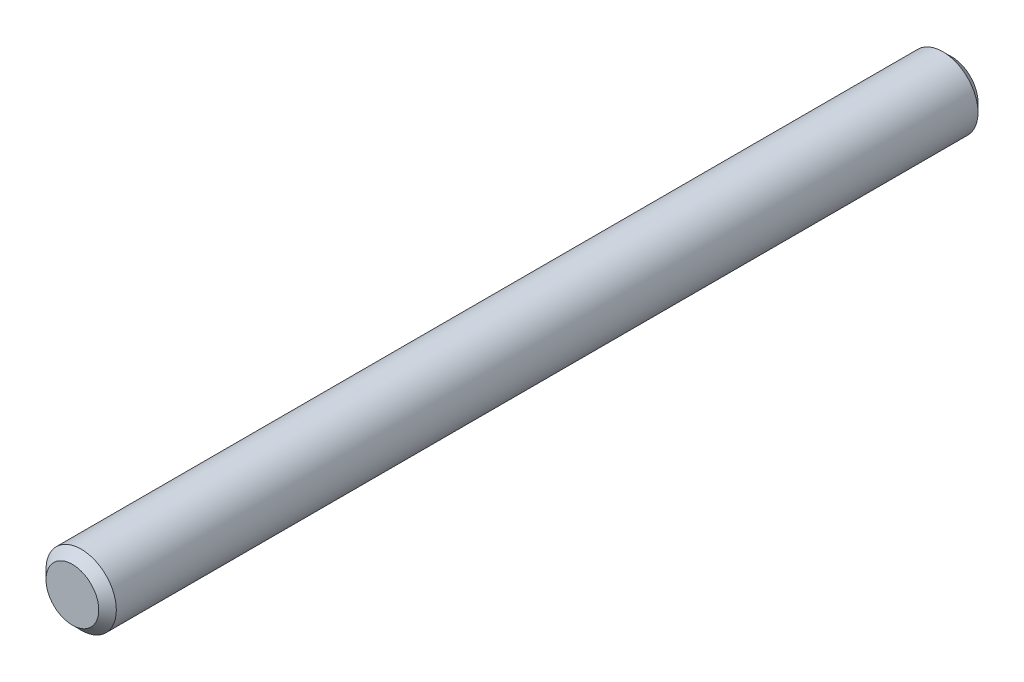
ISO-10303-21;
HEADER;
FILE_DESCRIPTION(('STEP AP214'),'2;1');
FILE_NAME('part.step','',(''),(''),'','','');
FILE_SCHEMA(('AUTOMOTIVE_DESIGN { 1 0 10303 214 1 1 1 1 }'));
ENDSEC;
DATA;
#1=APPLICATION_CONTEXT('core data for automotive mechanical design processes');
#2=APPLICATION_PROTOCOL_DEFINITION('international standard','automotive_design',2000,#1);
#3=PRODUCT_CONTEXT('',#1,'mechanical');
#4=PRODUCT('Part','Part','',(#3));
#5=PRODUCT_RELATED_PRODUCT_CATEGORY('part','',(#4));
#6=PRODUCT_DEFINITION_FORMATION('','',#4);
#7=PRODUCT_DEFINITION_CONTEXT('part definition',#1,'design');
#8=PRODUCT_DEFINITION('design','',#6,#7);
#9=PRODUCT_DEFINITION_SHAPE('','',#8);
#10=(LENGTH_UNIT() NAMED_UNIT(*) SI_UNIT(.MILLI.,.METRE.));
#11=(NAMED_UNIT(*) PLANE_ANGLE_UNIT() SI_UNIT($,.RADIAN.));
#12=(NAMED_UNIT(*) SI_UNIT($,.STERADIAN.) SOLID_ANGLE_UNIT());
#13=UNCERTAINTY_MEASURE_WITH_UNIT(LENGTH_MEASURE(1.E-05),#10,'distance_accuracy_value','');
#14=(GEOMETRIC_REPRESENTATION_CONTEXT(3) GLOBAL_UNCERTAINTY_ASSIGNED_CONTEXT((#13)) GLOBAL_UNIT_ASSIGNED_CONTEXT((#10,
#11,#12)) REPRESENTATION_CONTEXT('',''));
#15=CARTESIAN_POINT('',(0.,0.,0.));
#16=DIRECTION('',(0.,0.,1.));
#17=DIRECTION('',(1.,0.,0.));
#18=AXIS2_PLACEMENT_3D('',#15,#16,#17);
#19=CARTESIAN_POINT('',(0.,0.,25.));
#20=DIRECTION('',(0.,0.,-1.));
#21=DIRECTION('',(-1.,0.,0.));
#22=AXIS2_PLACEMENT_3D('',#19,#20,#21);
#23=CYLINDRICAL_SURFACE('',#22,2.);
#24=CARTESIAN_POINT('',(0.,0.,-24.5));
#25=DIRECTION('',(0.,0.,1.));
#26=DIRECTION('',(1.,0.,0.));
#27=AXIS2_PLACEMENT_3D('',#24,#25,#26);
#28=CIRCLE('',#27,2.);
#29=CARTESIAN_POINT('',(2.,0.,-24.5));
#30=VERTEX_POINT('',#29);
#31=EDGE_CURVE('E27',#30,#30,#28,.T.);
#32=ORIENTED_EDGE('',*,*,#31,.T.);
#33=EDGE_LOOP('',(#32));
#34=FACE_BOUND('',#33,.T.);
#35=CARTESIAN_POINT('',(0.,0.,24.5));
#36=DIRECTION('',(0.,0.,1.));
#37=DIRECTION('',(1.,0.,0.));
#38=AXIS2_PLACEMENT_3D('',#35,#36,#37);
#39=CIRCLE('',#38,2.);
#40=CARTESIAN_POINT('',(2.,0.,24.5));
#41=VERTEX_POINT('',#40);
#42=EDGE_CURVE('E31',#41,#41,#39,.F.);
#43=ORIENTED_EDGE('',*,*,#42,.T.);
#44=EDGE_LOOP('',(#43));
#45=FACE_BOUND('',#44,.T.);
#46=ADVANCED_FACE('F15',(#34,#45),#23,.T.);
#47=CARTESIAN_POINT('',(0.,0.,25.));
#48=DIRECTION('',(0.,0.,1.));
#49=DIRECTION('',(1.,0.,0.));
#50=AXIS2_PLACEMENT_3D('',#47,#48,#49);
#51=PLANE('',#50);
#52=CARTESIAN_POINT('',(0.,0.,25.));
#53=DIRECTION('',(0.,0.,1.));
#54=DIRECTION('',(1.,0.,0.));
#55=AXIS2_PLACEMENT_3D('',#52,#53,#54);
#56=CIRCLE('',#55,1.5);
#57=CARTESIAN_POINT('',(1.5,0.,25.));
#58=VERTEX_POINT('',#57);
#59=EDGE_CURVE('E10',#58,#58,#56,.T.);
#60=ORIENTED_EDGE('',*,*,#59,.T.);
#61=EDGE_LOOP('',(#60));
#62=FACE_BOUND('',#61,.T.);
#63=ADVANCED_FACE('F48',(#62),#51,.T.);
#64=CARTESIAN_POINT('',(0.,0.,-25.));
#65=DIRECTION('',(0.,0.,1.));
#66=DIRECTION('',(1.,0.,0.));
#67=AXIS2_PLACEMENT_3D('',#64,#65,#66);
#68=PLANE('',#67);
#69=CARTESIAN_POINT('',(0.,0.,-25.));
#70=DIRECTION('',(0.,0.,1.));
#71=DIRECTION('',(1.,0.,0.));
#72=AXIS2_PLACEMENT_3D('',#69,#70,#71);
#73=CIRCLE('',#72,1.49999999999999);
#74=CARTESIAN_POINT('',(1.49999999999999,0.,-25.));
#75=VERTEX_POINT('',#74);
#76=EDGE_CURVE('E23',#75,#75,#73,.F.);
#77=ORIENTED_EDGE('',*,*,#76,.T.);
#78=EDGE_LOOP('',(#77));
#79=FACE_BOUND('',#78,.T.);
#80=ADVANCED_FACE('F45',(#79),#68,.F.);
#81=CARTESIAN_POINT('',(0.,0.,-24.5));
#82=DIRECTION('',(0.,0.,1.));
#83=DIRECTION('',(1.,0.,0.));
#84=AXIS2_PLACEMENT_3D('',#81,#82,#83);
#85=CONICAL_SURFACE('',#84,2.,0.785398163397453);
#86=ORIENTED_EDGE('',*,*,#76,.F.);
#87=EDGE_LOOP('',(#86));
#88=FACE_BOUND('',#87,.T.);
#89=ORIENTED_EDGE('',*,*,#31,.F.);
#90=EDGE_LOOP('',(#89));
#91=FACE_BOUND('',#90,.T.);
#92=ADVANCED_FACE('F40',(#88,#91),#85,.T.);
#93=CARTESIAN_POINT('',(0.,0.,25.));
#94=DIRECTION('',(0.,0.,-1.));
#95=DIRECTION('',(-1.,0.,0.));
#96=AXIS2_PLACEMENT_3D('',#93,#94,#95);
#97=CONICAL_SURFACE('',#96,1.5,0.785398163397439);
#98=ORIENTED_EDGE('',*,*,#42,.F.);
#99=EDGE_LOOP('',(#98));
#100=FACE_BOUND('',#99,.T.);
#101=ORIENTED_EDGE('',*,*,#59,.F.);
#102=EDGE_LOOP('',(#101));
#103=FACE_BOUND('',#102,.T.);
#104=ADVANCED_FACE('F18',(#100,#103),#97,.T.);
#105=CLOSED_SHELL('',(#46,#63,#80,#92,#104));
#106=MANIFOLD_SOLID_BREP('B1',#105);
#107=ADVANCED_BREP_SHAPE_REPRESENTATION('',(#18,#106),#14);
#108=SHAPE_DEFINITION_REPRESENTATION(#9,#107);
ENDSEC;
END-ISO-10303-21;
